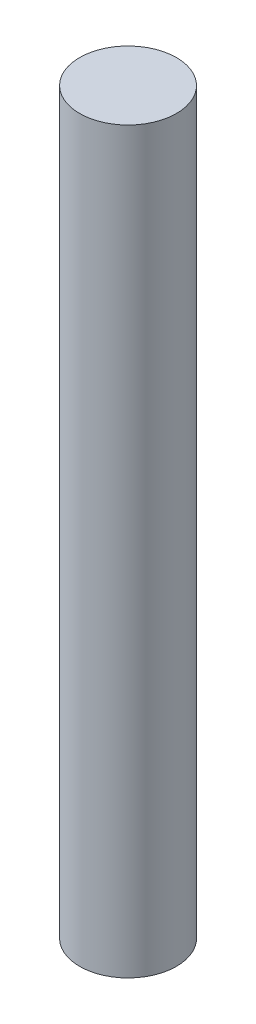
ISO-10303-21;
HEADER;
FILE_DESCRIPTION(('STEP AP214'),'2;1');
FILE_NAME('part.step','',(''),(''),'','','');
FILE_SCHEMA(('AUTOMOTIVE_DESIGN { 1 0 10303 214 1 1 1 1 }'));
ENDSEC;
DATA;
#1=APPLICATION_CONTEXT('core data for automotive mechanical design processes');
#2=APPLICATION_PROTOCOL_DEFINITION('international standard','automotive_design',2000,#1);
#3=PRODUCT_CONTEXT('',#1,'mechanical');
#4=PRODUCT('Part','Part','',(#3));
#5=PRODUCT_RELATED_PRODUCT_CATEGORY('part','',(#4));
#6=PRODUCT_DEFINITION_FORMATION('','',#4);
#7=PRODUCT_DEFINITION_CONTEXT('part definition',#1,'design');
#8=PRODUCT_DEFINITION('design','',#6,#7);
#9=PRODUCT_DEFINITION_SHAPE('','',#8);
#10=(LENGTH_UNIT() NAMED_UNIT(*) SI_UNIT(.MILLI.,.METRE.));
#11=(NAMED_UNIT(*) PLANE_ANGLE_UNIT() SI_UNIT($,.RADIAN.));
#12=(NAMED_UNIT(*) SI_UNIT($,.STERADIAN.) SOLID_ANGLE_UNIT());
#13=UNCERTAINTY_MEASURE_WITH_UNIT(LENGTH_MEASURE(1.E-05),#10,'distance_accuracy_value','');
#14=(GEOMETRIC_REPRESENTATION_CONTEXT(3) GLOBAL_UNCERTAINTY_ASSIGNED_CONTEXT((#13)) GLOBAL_UNIT_ASSIGNED_CONTEXT((#10,
#11,#12)) REPRESENTATION_CONTEXT('',''));
#15=CARTESIAN_POINT('',(0.,0.,0.));
#16=DIRECTION('',(0.,0.,1.));
#17=DIRECTION('',(1.,0.,0.));
#18=AXIS2_PLACEMENT_3D('',#15,#16,#17);
#19=CARTESIAN_POINT('',(0.,15.25,0.));
#20=DIRECTION('',(0.,1.,0.));
#21=DIRECTION('',(0.,0.,1.));
#22=AXIS2_PLACEMENT_3D('',#19,#20,#21);
#23=PLANE('',#22);
#24=CARTESIAN_POINT('',(0.,15.25,0.));
#25=DIRECTION('',(0.,-1.,0.));
#26=DIRECTION('',(0.,0.,-1.));
#27=AXIS2_PLACEMENT_3D('',#24,#25,#26);
#28=CIRCLE('',#27,2.);
#29=CARTESIAN_POINT('',(0.,15.25,-2.));
#30=VERTEX_POINT('',#29);
#31=EDGE_CURVE('E10',#30,#30,#28,.T.);
#32=ORIENTED_EDGE('',*,*,#31,.F.);
#33=EDGE_LOOP('',(#32));
#34=FACE_BOUND('',#33,.T.);
#35=ADVANCED_FACE('F30',(#34),#23,.T.);
#36=CARTESIAN_POINT('',(0.,0.,0.));
#37=DIRECTION('',(0.,-1.,0.));
#38=DIRECTION('',(0.,0.,-1.));
#39=AXIS2_PLACEMENT_3D('',#36,#37,#38);
#40=CYLINDRICAL_SURFACE('',#39,2.);
#41=ORIENTED_EDGE('',*,*,#31,.T.);
#42=EDGE_LOOP('',(#41));
#43=FACE_BOUND('',#42,.T.);
#44=CARTESIAN_POINT('',(0.,-15.25,0.));
#45=DIRECTION('',(0.,-1.,0.));
#46=DIRECTION('',(0.,0.,-1.));
#47=AXIS2_PLACEMENT_3D('',#44,#45,#46);
#48=CIRCLE('',#47,2.);
#49=CARTESIAN_POINT('',(0.,-15.25,-2.));
#50=VERTEX_POINT('',#49);
#51=EDGE_CURVE('E36',#50,#50,#48,.T.);
#52=ORIENTED_EDGE('',*,*,#51,.F.);
#53=EDGE_LOOP('',(#52));
#54=FACE_BOUND('',#53,.T.);
#55=ADVANCED_FACE('F44',(#43,#54),#40,.T.);
#56=CARTESIAN_POINT('',(0.,-15.25,0.));
#57=DIRECTION('',(0.,-1.,0.));
#58=DIRECTION('',(0.,0.,-1.));
#59=AXIS2_PLACEMENT_3D('',#56,#57,#58);
#60=PLANE('',#59);
#61=ORIENTED_EDGE('',*,*,#51,.T.);
#62=EDGE_LOOP('',(#61));
#63=FACE_BOUND('',#62,.T.);
#64=ADVANCED_FACE('F42',(#63),#60,.T.);
#65=CLOSED_SHELL('',(#35,#55,#64));
#66=MANIFOLD_SOLID_BREP('B2',#65);
#67=ADVANCED_BREP_SHAPE_REPRESENTATION('',(#18,#66),#14);
#68=SHAPE_DEFINITION_REPRESENTATION(#9,#67);
ENDSEC;
END-ISO-10303-21;
